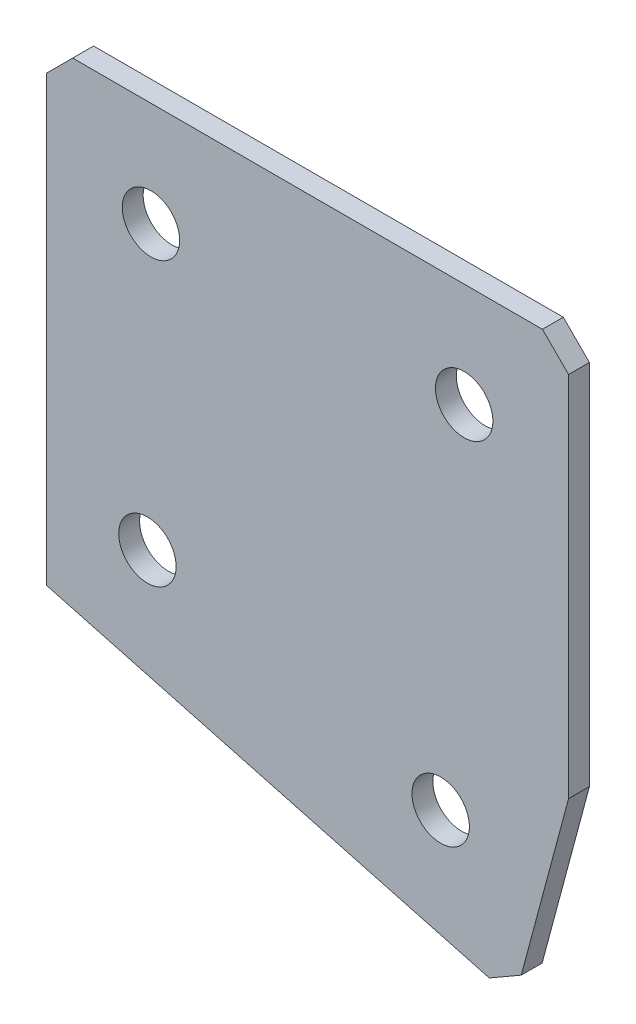
ISO-10303-21;
HEADER;
FILE_DESCRIPTION(('STEP AP214'),'2;1');
FILE_NAME('part.step','',(''),(''),'','','');
FILE_SCHEMA(('AUTOMOTIVE_DESIGN { 1 0 10303 214 1 1 1 1 }'));
ENDSEC;
DATA;
#1=APPLICATION_CONTEXT('core data for automotive mechanical design processes');
#2=APPLICATION_PROTOCOL_DEFINITION('international standard','automotive_design',2000,#1);
#3=PRODUCT_CONTEXT('',#1,'mechanical');
#4=PRODUCT('Part','Part','',(#3));
#5=PRODUCT_RELATED_PRODUCT_CATEGORY('part','',(#4));
#6=PRODUCT_DEFINITION_FORMATION('','',#4);
#7=PRODUCT_DEFINITION_CONTEXT('part definition',#1,'design');
#8=PRODUCT_DEFINITION('design','',#6,#7);
#9=PRODUCT_DEFINITION_SHAPE('','',#8);
#10=(LENGTH_UNIT() NAMED_UNIT(*) SI_UNIT(.MILLI.,.METRE.));
#11=(NAMED_UNIT(*) PLANE_ANGLE_UNIT() SI_UNIT($,.RADIAN.));
#12=(NAMED_UNIT(*) SI_UNIT($,.STERADIAN.) SOLID_ANGLE_UNIT());
#13=UNCERTAINTY_MEASURE_WITH_UNIT(LENGTH_MEASURE(1.E-05),#10,'distance_accuracy_value','');
#14=(GEOMETRIC_REPRESENTATION_CONTEXT(3) GLOBAL_UNCERTAINTY_ASSIGNED_CONTEXT((#13)) GLOBAL_UNIT_ASSIGNED_CONTEXT((#10,
#11,#12)) REPRESENTATION_CONTEXT('',''));
#15=CARTESIAN_POINT('',(0.,0.,0.));
#16=DIRECTION('',(0.,0.,1.));
#17=DIRECTION('',(1.,0.,0.));
#18=AXIS2_PLACEMENT_3D('',#15,#16,#17);
#19=CARTESIAN_POINT('',(0.,0.,-2.));
#20=DIRECTION('',(1.,0.,0.));
#21=DIRECTION('',(0.,0.,-1.));
#22=AXIS2_PLACEMENT_3D('',#19,#20,#21);
#23=PLANE('',#22);
#24=DIRECTION('',(0.,1.,0.));
#25=VECTOR('',#24,1.);
#26=CARTESIAN_POINT('',(0.,0.,0.));
#27=LINE('',#26,#25);
#28=CARTESIAN_POINT('',(0.,-45.,0.));
#29=VERTEX_POINT('',#28);
#30=CARTESIAN_POINT('',(0.,-2.50000000000002,0.));
#31=VERTEX_POINT('',#30);
#32=EDGE_CURVE('E129',#29,#31,#27,.T.);
#33=ORIENTED_EDGE('',*,*,#32,.T.);
#34=DIRECTION('',(0.,0.,-1.));
#35=VECTOR('',#34,1.);
#36=CARTESIAN_POINT('',(0.,-2.50000000000002,-2.));
#37=LINE('',#36,#35);
#38=CARTESIAN_POINT('',(0.,-2.50000000000002,-2.));
#39=VERTEX_POINT('',#38);
#40=EDGE_CURVE('E11',#31,#39,#37,.T.);
#41=ORIENTED_EDGE('',*,*,#40,.T.);
#42=DIRECTION('',(0.,1.,0.));
#43=VECTOR('',#42,1.);
#44=CARTESIAN_POINT('',(0.,0.,-2.));
#45=LINE('',#44,#43);
#46=CARTESIAN_POINT('',(0.,-45.,-2.));
#47=VERTEX_POINT('',#46);
#48=EDGE_CURVE('E140',#47,#39,#45,.T.);
#49=ORIENTED_EDGE('',*,*,#48,.F.);
#50=DIRECTION('',(0.,0.,1.));
#51=VECTOR('',#50,1.);
#52=CARTESIAN_POINT('',(0.,-45.,-2.));
#53=LINE('',#52,#51);
#54=EDGE_CURVE('E119',#47,#29,#53,.T.);
#55=ORIENTED_EDGE('',*,*,#54,.T.);
#56=EDGE_LOOP('',(#33,#41,#49,#55));
#57=FACE_BOUND('',#56,.T.);
#58=ADVANCED_FACE('F36',(#57),#23,.F.);
#59=CARTESIAN_POINT('',(0.,0.,-2.));
#60=DIRECTION('',(0.,-1.,0.));
#61=DIRECTION('',(0.,0.,-1.));
#62=AXIS2_PLACEMENT_3D('',#59,#60,#61);
#63=PLANE('',#62);
#64=DIRECTION('',(1.,0.,0.));
#65=VECTOR('',#64,1.);
#66=CARTESIAN_POINT('',(0.,0.,0.));
#67=LINE('',#66,#65);
#68=CARTESIAN_POINT('',(2.50000000000002,0.,0.));
#69=VERTEX_POINT('',#68);
#70=CARTESIAN_POINT('',(47.5,0.,0.));
#71=VERTEX_POINT('',#70);
#72=EDGE_CURVE('E132',#69,#71,#67,.T.);
#73=ORIENTED_EDGE('',*,*,#72,.T.);
#74=DIRECTION('',(0.,0.,-1.));
#75=VECTOR('',#74,1.);
#76=CARTESIAN_POINT('',(47.5,0.,-2.));
#77=LINE('',#76,#75);
#78=CARTESIAN_POINT('',(47.5,0.,-2.));
#79=VERTEX_POINT('',#78);
#80=EDGE_CURVE('E44',#71,#79,#77,.T.);
#81=ORIENTED_EDGE('',*,*,#80,.T.);
#82=DIRECTION('',(1.,0.,0.));
#83=VECTOR('',#82,1.);
#84=CARTESIAN_POINT('',(0.,0.,-2.));
#85=LINE('',#84,#83);
#86=CARTESIAN_POINT('',(2.50000000000002,0.,-2.));
#87=VERTEX_POINT('',#86);
#88=EDGE_CURVE('E108',#87,#79,#85,.T.);
#89=ORIENTED_EDGE('',*,*,#88,.F.);
#90=DIRECTION('',(0.,0.,1.));
#91=VECTOR('',#90,1.);
#92=CARTESIAN_POINT('',(2.50000000000002,0.,-2.));
#93=LINE('',#92,#91);
#94=EDGE_CURVE('E159',#87,#69,#93,.T.);
#95=ORIENTED_EDGE('',*,*,#94,.T.);
#96=EDGE_LOOP('',(#73,#81,#89,#95));
#97=FACE_BOUND('',#96,.T.);
#98=ADVANCED_FACE('F163',(#97),#63,.F.);
#99=CARTESIAN_POINT('',(50.,0.,-2.));
#100=DIRECTION('',(-1.,0.,0.));
#101=DIRECTION('',(0.,-1.,0.));
#102=AXIS2_PLACEMENT_3D('',#99,#100,#101);
#103=PLANE('',#102);
#104=DIRECTION('',(0.,-1.,0.));
#105=VECTOR('',#104,1.);
#106=CARTESIAN_POINT('',(50.,0.,-2.));
#107=LINE('',#106,#105);
#108=CARTESIAN_POINT('',(50.,-2.5,-2.));
#109=VERTEX_POINT('',#108);
#110=CARTESIAN_POINT('',(50.,-37.6919360133545,-2.));
#111=VERTEX_POINT('',#110);
#112=EDGE_CURVE('E99',#109,#111,#107,.T.);
#113=ORIENTED_EDGE('',*,*,#112,.F.);
#114=DIRECTION('',(0.,0.,1.));
#115=VECTOR('',#114,1.);
#116=CARTESIAN_POINT('',(50.,-2.5,-2.));
#117=LINE('',#116,#115);
#118=CARTESIAN_POINT('',(50.,-2.5,0.));
#119=VERTEX_POINT('',#118);
#120=EDGE_CURVE('E157',#109,#119,#117,.T.);
#121=ORIENTED_EDGE('',*,*,#120,.T.);
#122=DIRECTION('',(0.,-1.,0.));
#123=VECTOR('',#122,1.);
#124=CARTESIAN_POINT('',(50.,0.,0.));
#125=LINE('',#124,#123);
#126=CARTESIAN_POINT('',(50.,-37.6919360133545,0.));
#127=VERTEX_POINT('',#126);
#128=EDGE_CURVE('E114',#119,#127,#125,.T.);
#129=ORIENTED_EDGE('',*,*,#128,.T.);
#130=DIRECTION('',(0.,0.,1.));
#131=VECTOR('',#130,1.);
#132=CARTESIAN_POINT('',(50.,-37.6919360133545,-2.));
#133=LINE('',#132,#131);
#134=EDGE_CURVE('E111',#111,#127,#133,.T.);
#135=ORIENTED_EDGE('',*,*,#134,.F.);
#136=EDGE_LOOP('',(#113,#121,#129,#135));
#137=FACE_BOUND('',#136,.T.);
#138=ADVANCED_FACE('F112',(#137),#103,.F.);
#139=CARTESIAN_POINT('',(44.8236190979496,-57.0104525391359,-2.));
#140=DIRECTION('',(-0.965925826289068,0.258819045102521,0.));
#141=DIRECTION('',(-0.258819045102521,-0.965925826289068,0.));
#142=AXIS2_PLACEMENT_3D('',#139,#140,#141);
#143=PLANE('',#142);
#144=DIRECTION('',(-0.258819045102521,-0.965925826289068,0.));
#145=VECTOR('',#144,1.);
#146=CARTESIAN_POINT('',(44.8236190979496,-57.0104525391359,0.));
#147=LINE('',#146,#145);
#148=CARTESIAN_POINT('',(45.4706667107059,-54.5956379734132,0.));
#149=VERTEX_POINT('',#148);
#150=EDGE_CURVE('E136',#127,#149,#147,.T.);
#151=ORIENTED_EDGE('',*,*,#150,.T.);
#152=DIRECTION('',(0.,0.,-1.));
#153=VECTOR('',#152,1.);
#154=CARTESIAN_POINT('',(45.4706667107059,-54.5956379734132,-2.));
#155=LINE('',#154,#153);
#156=CARTESIAN_POINT('',(45.4706667107059,-54.5956379734132,-2.));
#157=VERTEX_POINT('',#156);
#158=EDGE_CURVE('E123',#149,#157,#155,.T.);
#159=ORIENTED_EDGE('',*,*,#158,.T.);
#160=DIRECTION('',(-0.258819045102521,-0.965925826289068,0.));
#161=VECTOR('',#160,1.);
#162=CARTESIAN_POINT('',(44.8236190979496,-57.0104525391359,-2.));
#163=LINE('',#162,#161);
#164=EDGE_CURVE('E103',#111,#157,#163,.T.);
#165=ORIENTED_EDGE('',*,*,#164,.F.);
#166=ORIENTED_EDGE('',*,*,#134,.T.);
#167=EDGE_LOOP('',(#151,#159,#165,#166));
#168=FACE_BOUND('',#167,.T.);
#169=ADVANCED_FACE('F121',(#168),#143,.F.);
#170=CARTESIAN_POINT('',(0.,-45.,-2.));
#171=DIRECTION('',(0.258819045102521,0.965925826289068,0.));
#172=DIRECTION('',(-0.965925826289068,0.258819045102521,0.));
#173=AXIS2_PLACEMENT_3D('',#170,#171,#172);
#174=PLANE('',#173);
#175=DIRECTION('',(-0.965925826289068,0.258819045102522,0.));
#176=VECTOR('',#175,1.);
#177=CARTESIAN_POINT('',(0.,-45.,-2.));
#178=LINE('',#177,#176);
#179=CARTESIAN_POINT('',(42.4088045322269,-56.3634049263796,-2.));
#180=VERTEX_POINT('',#179);
#181=EDGE_CURVE('E124',#180,#47,#178,.T.);
#182=ORIENTED_EDGE('',*,*,#181,.F.);
#183=DIRECTION('',(0.,0.,1.));
#184=VECTOR('',#183,1.);
#185=CARTESIAN_POINT('',(42.4088045322269,-56.3634049263796,-2.));
#186=LINE('',#185,#184);
#187=CARTESIAN_POINT('',(42.4088045322269,-56.3634049263796,0.));
#188=VERTEX_POINT('',#187);
#189=EDGE_CURVE('E118',#180,#188,#186,.T.);
#190=ORIENTED_EDGE('',*,*,#189,.T.);
#191=DIRECTION('',(-0.965925826289068,0.258819045102522,0.));
#192=VECTOR('',#191,1.);
#193=CARTESIAN_POINT('',(0.,-45.,0.));
#194=LINE('',#193,#192);
#195=EDGE_CURVE('E138',#188,#29,#194,.T.);
#196=ORIENTED_EDGE('',*,*,#195,.T.);
#197=ORIENTED_EDGE('',*,*,#54,.F.);
#198=EDGE_LOOP('',(#182,#190,#196,#197));
#199=FACE_BOUND('',#198,.T.);
#200=ADVANCED_FACE('F193',(#199),#174,.F.);
#201=CARTESIAN_POINT('',(0.,0.,-2.));
#202=DIRECTION('',(0.,0.,1.));
#203=DIRECTION('',(1.,0.,0.));
#204=AXIS2_PLACEMENT_3D('',#201,#202,#203);
#205=PLANE('',#204);
#206=CARTESIAN_POINT('',(10.,-10.,-2.));
#207=DIRECTION('',(0.,0.,-1.));
#208=DIRECTION('',(0.,1.,0.));
#209=AXIS2_PLACEMENT_3D('',#206,#207,#208);
#210=CIRCLE('',#209,2.75);
#211=CARTESIAN_POINT('',(10.,-7.25,-2.));
#212=VERTEX_POINT('',#211);
#213=EDGE_CURVE('E225',#212,#212,#210,.T.);
#214=ORIENTED_EDGE('',*,*,#213,.F.);
#215=EDGE_LOOP('',(#214));
#216=FACE_BOUND('',#215,.T.);
#217=CARTESIAN_POINT('',(40.,-10.,-2.));
#218=DIRECTION('',(0.,0.,-1.));
#219=DIRECTION('',(0.,1.,0.));
#220=AXIS2_PLACEMENT_3D('',#217,#218,#219);
#221=CIRCLE('',#220,2.75);
#222=CARTESIAN_POINT('',(40.,-7.25,-2.));
#223=VERTEX_POINT('',#222);
#224=EDGE_CURVE('E227',#223,#223,#221,.T.);
#225=ORIENTED_EDGE('',*,*,#224,.F.);
#226=EDGE_LOOP('',(#225));
#227=FACE_BOUND('',#226,.T.);
#228=CARTESIAN_POINT('',(9.65925826289068,-37.2354286469244,-2.));
#229=DIRECTION('',(0.,0.,-1.));
#230=DIRECTION('',(0.,1.,0.));
#231=AXIS2_PLACEMENT_3D('',#228,#229,#230);
#232=CIRCLE('',#231,2.75);
#233=CARTESIAN_POINT('',(9.65925826289068,-34.4854286469244,-2.));
#234=VERTEX_POINT('',#233);
#235=EDGE_CURVE('E235',#234,#234,#232,.T.);
#236=ORIENTED_EDGE('',*,*,#235,.F.);
#237=EDGE_LOOP('',(#236));
#238=FACE_BOUND('',#237,.T.);
#239=CARTESIAN_POINT('',(37.7525512860841,-44.76300382522,-2.));
#240=DIRECTION('',(0.,0.,-1.));
#241=DIRECTION('',(0.,1.,0.));
#242=AXIS2_PLACEMENT_3D('',#239,#240,#241);
#243=CIRCLE('',#242,2.75);
#244=CARTESIAN_POINT('',(37.7525512860841,-42.01300382522,-2.));
#245=VERTEX_POINT('',#244);
#246=EDGE_CURVE('E241',#245,#245,#243,.T.);
#247=ORIENTED_EDGE('',*,*,#246,.F.);
#248=EDGE_LOOP('',(#247));
#249=FACE_BOUND('',#248,.T.);
#250=ORIENTED_EDGE('',*,*,#164,.T.);
#251=DIRECTION('',(0.86602540378444,0.499999999999998,0.));
#252=VECTOR('',#251,1.);
#253=CARTESIAN_POINT('',(42.4088045322269,-56.3634049263796,-2.));
#254=LINE('',#253,#252);
#255=EDGE_CURVE('E155',#157,#180,#254,.F.);
#256=ORIENTED_EDGE('',*,*,#255,.T.);
#257=ORIENTED_EDGE('',*,*,#181,.T.);
#258=ORIENTED_EDGE('',*,*,#48,.T.);
#259=DIRECTION('',(-0.707106781186548,-0.707106781186548,0.));
#260=VECTOR('',#259,1.);
#261=CARTESIAN_POINT('',(2.50000000000002,0.,-2.));
#262=LINE('',#261,#260);
#263=EDGE_CURVE('E152',#39,#87,#262,.F.);
#264=ORIENTED_EDGE('',*,*,#263,.T.);
#265=ORIENTED_EDGE('',*,*,#88,.T.);
#266=DIRECTION('',(-0.707106781186549,0.707106781186547,0.));
#267=VECTOR('',#266,1.);
#268=CARTESIAN_POINT('',(50.,-2.5,-2.));
#269=LINE('',#268,#267);
#270=EDGE_CURVE('E51',#79,#109,#269,.F.);
#271=ORIENTED_EDGE('',*,*,#270,.T.);
#272=ORIENTED_EDGE('',*,*,#112,.T.);
#273=EDGE_LOOP('',(#250,#256,#257,#258,#264,#265,#271,#272));
#274=FACE_BOUND('',#273,.T.);
#275=ADVANCED_FACE('F101',(#216,#227,#238,#249,#274),#205,.F.);
#276=CARTESIAN_POINT('',(0.,0.,0.));
#277=DIRECTION('',(0.,0.,1.));
#278=DIRECTION('',(1.,0.,0.));
#279=AXIS2_PLACEMENT_3D('',#276,#277,#278);
#280=PLANE('',#279);
#281=CARTESIAN_POINT('',(10.,-10.,0.));
#282=DIRECTION('',(0.,0.,-1.));
#283=DIRECTION('',(0.,1.,0.));
#284=AXIS2_PLACEMENT_3D('',#281,#282,#283);
#285=CIRCLE('',#284,2.75);
#286=CARTESIAN_POINT('',(10.,-7.25,0.));
#287=VERTEX_POINT('',#286);
#288=EDGE_CURVE('E222',#287,#287,#285,.T.);
#289=ORIENTED_EDGE('',*,*,#288,.T.);
#290=EDGE_LOOP('',(#289));
#291=FACE_BOUND('',#290,.T.);
#292=CARTESIAN_POINT('',(40.,-10.,0.));
#293=DIRECTION('',(0.,0.,-1.));
#294=DIRECTION('',(0.,1.,0.));
#295=AXIS2_PLACEMENT_3D('',#292,#293,#294);
#296=CIRCLE('',#295,2.75);
#297=CARTESIAN_POINT('',(40.,-7.25,0.));
#298=VERTEX_POINT('',#297);
#299=EDGE_CURVE('E232',#298,#298,#296,.T.);
#300=ORIENTED_EDGE('',*,*,#299,.T.);
#301=EDGE_LOOP('',(#300));
#302=FACE_BOUND('',#301,.T.);
#303=CARTESIAN_POINT('',(9.65925826289068,-37.2354286469244,0.));
#304=DIRECTION('',(0.,0.,-1.));
#305=DIRECTION('',(0.,1.,0.));
#306=AXIS2_PLACEMENT_3D('',#303,#304,#305);
#307=CIRCLE('',#306,2.75);
#308=CARTESIAN_POINT('',(9.65925826289068,-34.4854286469244,0.));
#309=VERTEX_POINT('',#308);
#310=EDGE_CURVE('E238',#309,#309,#307,.T.);
#311=ORIENTED_EDGE('',*,*,#310,.T.);
#312=EDGE_LOOP('',(#311));
#313=FACE_BOUND('',#312,.T.);
#314=CARTESIAN_POINT('',(37.7525512860841,-44.76300382522,0.));
#315=DIRECTION('',(0.,0.,-1.));
#316=DIRECTION('',(0.,1.,0.));
#317=AXIS2_PLACEMENT_3D('',#314,#315,#316);
#318=CIRCLE('',#317,2.75);
#319=CARTESIAN_POINT('',(37.7525512860841,-42.01300382522,0.));
#320=VERTEX_POINT('',#319);
#321=EDGE_CURVE('E133',#320,#320,#318,.T.);
#322=ORIENTED_EDGE('',*,*,#321,.T.);
#323=EDGE_LOOP('',(#322));
#324=FACE_BOUND('',#323,.T.);
#325=ORIENTED_EDGE('',*,*,#195,.F.);
#326=DIRECTION('',(-0.86602540378444,-0.499999999999998,0.));
#327=VECTOR('',#326,1.);
#328=CARTESIAN_POINT('',(35.0082713880734,-60.6361047293033,0.));
#329=LINE('',#328,#327);
#330=EDGE_CURVE('E149',#188,#149,#329,.F.);
#331=ORIENTED_EDGE('',*,*,#330,.T.);
#332=ORIENTED_EDGE('',*,*,#150,.F.);
#333=ORIENTED_EDGE('',*,*,#128,.F.);
#334=DIRECTION('',(0.707106781186549,-0.707106781186547,0.));
#335=VECTOR('',#334,1.);
#336=CARTESIAN_POINT('',(23.7499999999999,23.75,0.));
#337=LINE('',#336,#335);
#338=EDGE_CURVE('E147',#119,#71,#337,.F.);
#339=ORIENTED_EDGE('',*,*,#338,.T.);
#340=ORIENTED_EDGE('',*,*,#72,.F.);
#341=DIRECTION('',(0.707106781186548,0.707106781186548,0.));
#342=VECTOR('',#341,1.);
#343=CARTESIAN_POINT('',(1.25000000000001,-1.25000000000001,0.));
#344=LINE('',#343,#342);
#345=EDGE_CURVE('E145',#69,#31,#344,.F.);
#346=ORIENTED_EDGE('',*,*,#345,.T.);
#347=ORIENTED_EDGE('',*,*,#32,.F.);
#348=EDGE_LOOP('',(#325,#331,#332,#333,#339,#340,#346,#347));
#349=FACE_BOUND('',#348,.T.);
#350=ADVANCED_FACE('F168',(#291,#302,#313,#324,#349),#280,.T.);
#351=CARTESIAN_POINT('',(37.7525512860841,-44.76300382522,-2.));
#352=DIRECTION('',(0.,0.,-1.));
#353=DIRECTION('',(0.,1.,0.));
#354=AXIS2_PLACEMENT_3D('',#351,#352,#353);
#355=CYLINDRICAL_SURFACE('',#354,2.75);
#356=ORIENTED_EDGE('',*,*,#321,.F.);
#357=EDGE_LOOP('',(#356));
#358=FACE_BOUND('',#357,.T.);
#359=ORIENTED_EDGE('',*,*,#246,.T.);
#360=EDGE_LOOP('',(#359));
#361=FACE_BOUND('',#360,.T.);
#362=ADVANCED_FACE('F199',(#358,#361),#355,.F.);
#363=CARTESIAN_POINT('',(9.65925826289068,-37.2354286469244,-2.));
#364=DIRECTION('',(0.,0.,-1.));
#365=DIRECTION('',(0.,1.,0.));
#366=AXIS2_PLACEMENT_3D('',#363,#364,#365);
#367=CYLINDRICAL_SURFACE('',#366,2.75);
#368=ORIENTED_EDGE('',*,*,#310,.F.);
#369=EDGE_LOOP('',(#368));
#370=FACE_BOUND('',#369,.T.);
#371=ORIENTED_EDGE('',*,*,#235,.T.);
#372=EDGE_LOOP('',(#371));
#373=FACE_BOUND('',#372,.T.);
#374=ADVANCED_FACE('F206',(#370,#373),#367,.F.);
#375=CARTESIAN_POINT('',(40.,-10.,-2.));
#376=DIRECTION('',(0.,0.,-1.));
#377=DIRECTION('',(0.,1.,0.));
#378=AXIS2_PLACEMENT_3D('',#375,#376,#377);
#379=CYLINDRICAL_SURFACE('',#378,2.75);
#380=ORIENTED_EDGE('',*,*,#299,.F.);
#381=EDGE_LOOP('',(#380));
#382=FACE_BOUND('',#381,.T.);
#383=ORIENTED_EDGE('',*,*,#224,.T.);
#384=EDGE_LOOP('',(#383));
#385=FACE_BOUND('',#384,.T.);
#386=ADVANCED_FACE('F210',(#382,#385),#379,.F.);
#387=CARTESIAN_POINT('',(10.,-10.,-2.));
#388=DIRECTION('',(0.,0.,-1.));
#389=DIRECTION('',(0.,1.,0.));
#390=AXIS2_PLACEMENT_3D('',#387,#388,#389);
#391=CYLINDRICAL_SURFACE('',#390,2.75);
#392=ORIENTED_EDGE('',*,*,#288,.F.);
#393=EDGE_LOOP('',(#392));
#394=FACE_BOUND('',#393,.T.);
#395=ORIENTED_EDGE('',*,*,#213,.T.);
#396=EDGE_LOOP('',(#395));
#397=FACE_BOUND('',#396,.T.);
#398=ADVANCED_FACE('F178',(#394,#397),#391,.F.);
#399=CARTESIAN_POINT('',(42.4088045322269,-56.3634049263796,-2.));
#400=DIRECTION('',(-0.499999999999998,0.86602540378444,0.));
#401=DIRECTION('',(0.,0.,1.));
#402=AXIS2_PLACEMENT_3D('',#399,#400,#401);
#403=PLANE('',#402);
#404=ORIENTED_EDGE('',*,*,#255,.F.);
#405=ORIENTED_EDGE('',*,*,#158,.F.);
#406=ORIENTED_EDGE('',*,*,#330,.F.);
#407=ORIENTED_EDGE('',*,*,#189,.F.);
#408=EDGE_LOOP('',(#404,#405,#406,#407));
#409=FACE_BOUND('',#408,.T.);
#410=ADVANCED_FACE('F173',(#409),#403,.F.);
#411=CARTESIAN_POINT('',(50.,-2.5,-2.));
#412=DIRECTION('',(-0.707106781186546,-0.707106781186548,0.));
#413=DIRECTION('',(0.,0.,1.));
#414=AXIS2_PLACEMENT_3D('',#411,#412,#413);
#415=PLANE('',#414);
#416=ORIENTED_EDGE('',*,*,#270,.F.);
#417=ORIENTED_EDGE('',*,*,#80,.F.);
#418=ORIENTED_EDGE('',*,*,#338,.F.);
#419=ORIENTED_EDGE('',*,*,#120,.F.);
#420=EDGE_LOOP('',(#416,#417,#418,#419));
#421=FACE_BOUND('',#420,.T.);
#422=ADVANCED_FACE('F171',(#421),#415,.F.);
#423=CARTESIAN_POINT('',(2.50000000000002,0.,-2.));
#424=DIRECTION('',(0.707106781186547,-0.707106781186547,0.));
#425=DIRECTION('',(0.,0.,1.));
#426=AXIS2_PLACEMENT_3D('',#423,#424,#425);
#427=PLANE('',#426);
#428=ORIENTED_EDGE('',*,*,#263,.F.);
#429=ORIENTED_EDGE('',*,*,#40,.F.);
#430=ORIENTED_EDGE('',*,*,#345,.F.);
#431=ORIENTED_EDGE('',*,*,#94,.F.);
#432=EDGE_LOOP('',(#428,#429,#430,#431));
#433=FACE_BOUND('',#432,.T.);
#434=ADVANCED_FACE('F38',(#433),#427,.F.);
#435=CLOSED_SHELL('',(#58,#98,#138,#169,#200,#275,#350,#362,#374,#386,#398,#410,#422,#434));
#436=MANIFOLD_SOLID_BREP('B2',#435);
#437=ADVANCED_BREP_SHAPE_REPRESENTATION('',(#18,#436),#14);
#438=SHAPE_DEFINITION_REPRESENTATION(#9,#437);
ENDSEC;
END-ISO-10303-21;
